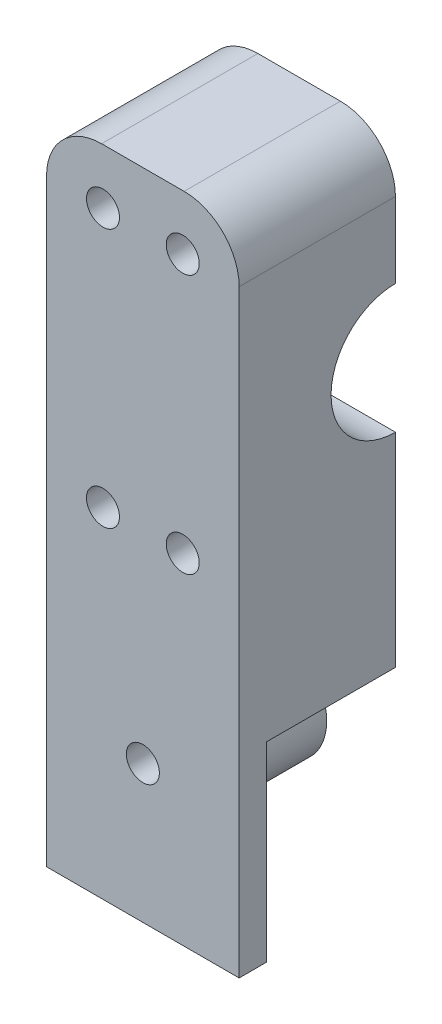
ISO-10303-21;
HEADER;
FILE_DESCRIPTION(('STEP AP214'),'2;1');
FILE_NAME('part.step','',(''),(''),'','','');
FILE_SCHEMA(('AUTOMOTIVE_DESIGN { 1 0 10303 214 1 1 1 1 }'));
ENDSEC;
DATA;
#1=APPLICATION_CONTEXT('core data for automotive mechanical design processes');
#2=APPLICATION_PROTOCOL_DEFINITION('international standard','automotive_design',2000,#1);
#3=PRODUCT_CONTEXT('',#1,'mechanical');
#4=PRODUCT('Part','Part','',(#3));
#5=PRODUCT_RELATED_PRODUCT_CATEGORY('part','',(#4));
#6=PRODUCT_DEFINITION_FORMATION('','',#4);
#7=PRODUCT_DEFINITION_CONTEXT('part definition',#1,'design');
#8=PRODUCT_DEFINITION('design','',#6,#7);
#9=PRODUCT_DEFINITION_SHAPE('','',#8);
#10=(LENGTH_UNIT() NAMED_UNIT(*) SI_UNIT(.MILLI.,.METRE.));
#11=(NAMED_UNIT(*) PLANE_ANGLE_UNIT() SI_UNIT($,.RADIAN.));
#12=(NAMED_UNIT(*) SI_UNIT($,.STERADIAN.) SOLID_ANGLE_UNIT());
#13=UNCERTAINTY_MEASURE_WITH_UNIT(LENGTH_MEASURE(1.E-05),#10,'distance_accuracy_value','');
#14=(GEOMETRIC_REPRESENTATION_CONTEXT(3) GLOBAL_UNCERTAINTY_ASSIGNED_CONTEXT((#13)) GLOBAL_UNIT_ASSIGNED_CONTEXT((#10,
#11,#12)) REPRESENTATION_CONTEXT('',''));
#15=CARTESIAN_POINT('',(0.,0.,0.));
#16=DIRECTION('',(0.,0.,1.));
#17=DIRECTION('',(1.,0.,0.));
#18=AXIS2_PLACEMENT_3D('',#15,#16,#17);
#19=CARTESIAN_POINT('',(10.25,49.4,-28.4));
#20=DIRECTION('',(0.,0.,1.));
#21=DIRECTION('',(1.,0.,0.));
#22=AXIS2_PLACEMENT_3D('',#19,#20,#21);
#23=CYLINDRICAL_SURFACE('',#22,3.);
#24=CARTESIAN_POINT('',(10.25,49.4,28.4));
#25=DIRECTION('',(0.,0.,-1.));
#26=DIRECTION('',(-1.,0.,0.));
#27=AXIS2_PLACEMENT_3D('',#24,#25,#26);
#28=CIRCLE('',#27,3.);
#29=CARTESIAN_POINT('',(7.25,49.4,28.4));
#30=VERTEX_POINT('',#29);
#31=EDGE_CURVE('E189',#30,#30,#28,.T.);
#32=ORIENTED_EDGE('',*,*,#31,.F.);
#33=EDGE_LOOP('',(#32));
#34=FACE_BOUND('',#33,.T.);
#35=CARTESIAN_POINT('',(10.25,49.4,5.));
#36=DIRECTION('',(0.,0.,-1.));
#37=DIRECTION('',(-1.,0.,0.));
#38=AXIS2_PLACEMENT_3D('',#35,#36,#37);
#39=CIRCLE('',#38,3.);
#40=CARTESIAN_POINT('',(7.25,49.4,5.));
#41=VERTEX_POINT('',#40);
#42=EDGE_CURVE('E297',#41,#41,#39,.T.);
#43=ORIENTED_EDGE('',*,*,#42,.T.);
#44=EDGE_LOOP('',(#43));
#45=FACE_BOUND('',#44,.T.);
#46=ADVANCED_FACE('F39',(#34,#45),#23,.F.);
#47=CARTESIAN_POINT('',(10.25,2.29999999999999,-28.4));
#48=DIRECTION('',(0.,0.,1.));
#49=DIRECTION('',(1.,0.,0.));
#50=AXIS2_PLACEMENT_3D('',#47,#48,#49);
#51=CYLINDRICAL_SURFACE('',#50,3.);
#52=CARTESIAN_POINT('',(10.25,2.29999999999999,28.4));
#53=DIRECTION('',(0.,0.,-1.));
#54=DIRECTION('',(-1.,0.,0.));
#55=AXIS2_PLACEMENT_3D('',#52,#53,#54);
#56=CIRCLE('',#55,3.);
#57=CARTESIAN_POINT('',(7.25,2.29999999999999,28.4));
#58=VERTEX_POINT('',#57);
#59=EDGE_CURVE('E197',#58,#58,#56,.T.);
#60=ORIENTED_EDGE('',*,*,#59,.F.);
#61=EDGE_LOOP('',(#60));
#62=FACE_BOUND('',#61,.T.);
#63=CARTESIAN_POINT('',(10.25,2.30000000000001,5.));
#64=DIRECTION('',(0.,0.,-1.));
#65=DIRECTION('',(-1.,0.,0.));
#66=AXIS2_PLACEMENT_3D('',#63,#64,#65);
#67=CIRCLE('',#66,3.);
#68=CARTESIAN_POINT('',(7.25,2.30000000000001,5.));
#69=VERTEX_POINT('',#68);
#70=EDGE_CURVE('E308',#69,#69,#67,.T.);
#71=ORIENTED_EDGE('',*,*,#70,.T.);
#72=EDGE_LOOP('',(#71));
#73=FACE_BOUND('',#72,.T.);
#74=ADVANCED_FACE('F352',(#62,#73),#51,.F.);
#75=CARTESIAN_POINT('',(24.75,2.29999999999999,-28.4));
#76=DIRECTION('',(0.,0.,1.));
#77=DIRECTION('',(1.,0.,0.));
#78=AXIS2_PLACEMENT_3D('',#75,#76,#77);
#79=CYLINDRICAL_SURFACE('',#78,3.);
#80=CARTESIAN_POINT('',(24.75,2.29999999999999,28.4));
#81=DIRECTION('',(0.,0.,-1.));
#82=DIRECTION('',(-1.,0.,0.));
#83=AXIS2_PLACEMENT_3D('',#80,#81,#82);
#84=CIRCLE('',#83,3.);
#85=CARTESIAN_POINT('',(21.75,2.29999999999999,28.4));
#86=VERTEX_POINT('',#85);
#87=EDGE_CURVE('E201',#86,#86,#84,.T.);
#88=ORIENTED_EDGE('',*,*,#87,.F.);
#89=EDGE_LOOP('',(#88));
#90=FACE_BOUND('',#89,.T.);
#91=CARTESIAN_POINT('',(24.75,2.30000000000001,5.));
#92=DIRECTION('',(0.,0.,-1.));
#93=DIRECTION('',(-1.,0.,0.));
#94=AXIS2_PLACEMENT_3D('',#91,#92,#93);
#95=CIRCLE('',#94,3.);
#96=CARTESIAN_POINT('',(21.75,2.30000000000001,5.));
#97=VERTEX_POINT('',#96);
#98=EDGE_CURVE('E298',#97,#97,#95,.T.);
#99=ORIENTED_EDGE('',*,*,#98,.T.);
#100=EDGE_LOOP('',(#99));
#101=FACE_BOUND('',#100,.T.);
#102=ADVANCED_FACE('F358',(#90,#101),#79,.F.);
#103=CARTESIAN_POINT('',(24.75,49.4,-28.4));
#104=DIRECTION('',(0.,0.,1.));
#105=DIRECTION('',(1.,0.,0.));
#106=AXIS2_PLACEMENT_3D('',#103,#104,#105);
#107=CYLINDRICAL_SURFACE('',#106,3.);
#108=CARTESIAN_POINT('',(24.75,49.4,28.4));
#109=DIRECTION('',(0.,0.,-1.));
#110=DIRECTION('',(-1.,0.,0.));
#111=AXIS2_PLACEMENT_3D('',#108,#109,#110);
#112=CIRCLE('',#111,3.);
#113=CARTESIAN_POINT('',(21.75,49.4,28.4));
#114=VERTEX_POINT('',#113);
#115=EDGE_CURVE('E205',#114,#114,#112,.T.);
#116=ORIENTED_EDGE('',*,*,#115,.F.);
#117=EDGE_LOOP('',(#116));
#118=FACE_BOUND('',#117,.T.);
#119=CARTESIAN_POINT('',(24.75,49.4,5.));
#120=DIRECTION('',(0.,0.,-1.));
#121=DIRECTION('',(-1.,0.,0.));
#122=AXIS2_PLACEMENT_3D('',#119,#120,#121);
#123=CIRCLE('',#122,3.);
#124=CARTESIAN_POINT('',(21.75,49.4,5.));
#125=VERTEX_POINT('',#124);
#126=EDGE_CURVE('E290',#125,#125,#123,.T.);
#127=ORIENTED_EDGE('',*,*,#126,.T.);
#128=EDGE_LOOP('',(#127));
#129=FACE_BOUND('',#128,.T.);
#130=ADVANCED_FACE('F365',(#118,#129),#107,.F.);
#131=CARTESIAN_POINT('',(17.5,-34.4,-60.1843274866922));
#132=DIRECTION('',(0.,0.,1.));
#133=DIRECTION('',(1.,0.,0.));
#134=AXIS2_PLACEMENT_3D('',#131,#132,#133);
#135=CYLINDRICAL_SURFACE('',#134,10.);
#136=CARTESIAN_POINT('',(17.5,-34.4,23.4));
#137=DIRECTION('',(0.,0.,1.));
#138=DIRECTION('',(0.,-1.,0.));
#139=AXIS2_PLACEMENT_3D('',#136,#137,#138);
#140=CIRCLE('',#139,10.);
#141=CARTESIAN_POINT('',(17.5,-44.4,23.4));
#142=VERTEX_POINT('',#141);
#143=EDGE_CURVE('E156',#142,#142,#140,.T.);
#144=ORIENTED_EDGE('',*,*,#143,.F.);
#145=EDGE_LOOP('',(#144));
#146=FACE_BOUND('',#145,.T.);
#147=CARTESIAN_POINT('',(17.5,-34.4,5.));
#148=DIRECTION('',(0.,0.,-1.));
#149=DIRECTION('',(0.,1.,0.));
#150=AXIS2_PLACEMENT_3D('',#147,#148,#149);
#151=CIRCLE('',#150,10.);
#152=CARTESIAN_POINT('',(17.5,-24.4,5.));
#153=VERTEX_POINT('',#152);
#154=EDGE_CURVE('E142',#153,#153,#151,.T.);
#155=ORIENTED_EDGE('',*,*,#154,.F.);
#156=EDGE_LOOP('',(#155));
#157=FACE_BOUND('',#156,.T.);
#158=ADVANCED_FACE('F369',(#146,#157),#135,.T.);
#159=CARTESIAN_POINT('',(17.5,-34.4,-28.4));
#160=DIRECTION('',(0.,0.,1.));
#161=DIRECTION('',(1.,0.,0.));
#162=AXIS2_PLACEMENT_3D('',#159,#160,#161);
#163=CYLINDRICAL_SURFACE('',#162,3.);
#164=CARTESIAN_POINT('',(17.5,-34.4,28.4));
#165=DIRECTION('',(0.,0.,-1.));
#166=DIRECTION('',(-1.,0.,0.));
#167=AXIS2_PLACEMENT_3D('',#164,#165,#166);
#168=CIRCLE('',#167,3.);
#169=CARTESIAN_POINT('',(14.5,-34.4,28.4));
#170=VERTEX_POINT('',#169);
#171=EDGE_CURVE('E193',#170,#170,#168,.T.);
#172=ORIENTED_EDGE('',*,*,#171,.F.);
#173=EDGE_LOOP('',(#172));
#174=FACE_BOUND('',#173,.T.);
#175=CARTESIAN_POINT('',(17.5,-34.4,5.));
#176=DIRECTION('',(0.,0.,-1.));
#177=DIRECTION('',(0.,1.,0.));
#178=AXIS2_PLACEMENT_3D('',#175,#176,#177);
#179=CIRCLE('',#178,3.);
#180=CARTESIAN_POINT('',(17.5,-31.4,5.));
#181=VERTEX_POINT('',#180);
#182=EDGE_CURVE('E281',#181,#181,#179,.T.);
#183=ORIENTED_EDGE('',*,*,#182,.T.);
#184=EDGE_LOOP('',(#183));
#185=FACE_BOUND('',#184,.T.);
#186=ADVANCED_FACE('F372',(#174,#185),#163,.F.);
#187=CARTESIAN_POINT('',(35.,0.,0.));
#188=DIRECTION('',(1.,0.,0.));
#189=DIRECTION('',(0.,0.,-1.));
#190=AXIS2_PLACEMENT_3D('',#187,#188,#189);
#191=PLANE('',#190);
#192=DIRECTION('',(0.,-1.,0.));
#193=VECTOR('',#192,1.);
#194=CARTESIAN_POINT('',(35.,59.4,0.));
#195=LINE('',#194,#193);
#196=CARTESIAN_POINT('',(35.,49.4,0.));
#197=VERTEX_POINT('',#196);
#198=CARTESIAN_POINT('',(35.,35.7,0.));
#199=VERTEX_POINT('',#198);
#200=EDGE_CURVE('E141',#197,#199,#195,.T.);
#201=ORIENTED_EDGE('',*,*,#200,.F.);
#202=DIRECTION('',(0.,0.,1.));
#203=VECTOR('',#202,1.);
#204=CARTESIAN_POINT('',(35.,49.4,28.4));
#205=LINE('',#204,#203);
#206=CARTESIAN_POINT('',(35.,49.4,28.4));
#207=VERTEX_POINT('',#206);
#208=EDGE_CURVE('E188',#197,#207,#205,.T.);
#209=ORIENTED_EDGE('',*,*,#208,.T.);
#210=DIRECTION('',(0.,-1.,0.));
#211=VECTOR('',#210,1.);
#212=CARTESIAN_POINT('',(35.,59.4,28.4));
#213=LINE('',#212,#211);
#214=CARTESIAN_POINT('',(35.,-59.4,28.4));
#215=VERTEX_POINT('',#214);
#216=EDGE_CURVE('E161',#207,#215,#213,.T.);
#217=ORIENTED_EDGE('',*,*,#216,.T.);
#218=DIRECTION('',(0.,0.,-1.));
#219=VECTOR('',#218,1.);
#220=CARTESIAN_POINT('',(35.,-59.4,28.4));
#221=LINE('',#220,#219);
#222=CARTESIAN_POINT('',(35.,-59.4,23.4));
#223=VERTEX_POINT('',#222);
#224=EDGE_CURVE('E164',#215,#223,#221,.T.);
#225=ORIENTED_EDGE('',*,*,#224,.T.);
#226=DIRECTION('',(0.,1.,0.));
#227=VECTOR('',#226,1.);
#228=CARTESIAN_POINT('',(35.,-14.4,23.4));
#229=LINE('',#228,#227);
#230=CARTESIAN_POINT('',(35.,-24.7175416344815,23.4));
#231=VERTEX_POINT('',#230);
#232=EDGE_CURVE('E168',#223,#231,#229,.T.);
#233=ORIENTED_EDGE('',*,*,#232,.T.);
#234=DIRECTION('',(0.,0.,1.));
#235=VECTOR('',#234,1.);
#236=CARTESIAN_POINT('',(35.,-24.7175416344815,-60.1843274866922));
#237=LINE('',#236,#235);
#238=CARTESIAN_POINT('',(35.,-24.7175416344815,0.));
#239=VERTEX_POINT('',#238);
#240=EDGE_CURVE('E139',#239,#231,#237,.T.);
#241=ORIENTED_EDGE('',*,*,#240,.F.);
#242=CARTESIAN_POINT('',(35.,12.3,0.));
#243=VERTEX_POINT('',#242);
#244=EDGE_CURVE('E120',#243,#239,#195,.T.);
#245=ORIENTED_EDGE('',*,*,#244,.F.);
#246=CARTESIAN_POINT('',(35.,24.,0.));
#247=DIRECTION('',(1.,0.,0.));
#248=DIRECTION('',(0.,0.,-1.));
#249=AXIS2_PLACEMENT_3D('',#246,#247,#248);
#250=CIRCLE('',#249,11.7);
#251=EDGE_CURVE('E137',#199,#243,#250,.T.);
#252=ORIENTED_EDGE('',*,*,#251,.F.);
#253=EDGE_LOOP('',(#201,#209,#217,#225,#233,#241,#245,#252));
#254=FACE_BOUND('',#253,.T.);
#255=ADVANCED_FACE('F136',(#254),#191,.T.);
#256=CARTESIAN_POINT('',(0.,0.,0.));
#257=DIRECTION('',(1.,0.,0.));
#258=DIRECTION('',(0.,0.,-1.));
#259=AXIS2_PLACEMENT_3D('',#256,#257,#258);
#260=PLANE('',#259);
#261=DIRECTION('',(0.,-1.,0.));
#262=VECTOR('',#261,1.);
#263=CARTESIAN_POINT('',(0.,59.4,28.4));
#264=LINE('',#263,#262);
#265=CARTESIAN_POINT('',(0.,49.4,28.4));
#266=VERTEX_POINT('',#265);
#267=CARTESIAN_POINT('',(0.,-59.4,28.4));
#268=VERTEX_POINT('',#267);
#269=EDGE_CURVE('E148',#266,#268,#264,.T.);
#270=ORIENTED_EDGE('',*,*,#269,.F.);
#271=DIRECTION('',(0.,0.,1.));
#272=VECTOR('',#271,1.);
#273=CARTESIAN_POINT('',(0.,49.4,0.));
#274=LINE('',#273,#272);
#275=CARTESIAN_POINT('',(0.,49.4,0.));
#276=VERTEX_POINT('',#275);
#277=EDGE_CURVE('E11',#266,#276,#274,.F.);
#278=ORIENTED_EDGE('',*,*,#277,.T.);
#279=DIRECTION('',(0.,-1.,0.));
#280=VECTOR('',#279,1.);
#281=CARTESIAN_POINT('',(0.,59.4,0.));
#282=LINE('',#281,#280);
#283=CARTESIAN_POINT('',(0.,35.7,0.));
#284=VERTEX_POINT('',#283);
#285=EDGE_CURVE('E274',#276,#284,#282,.T.);
#286=ORIENTED_EDGE('',*,*,#285,.T.);
#287=CARTESIAN_POINT('',(0.,24.,0.));
#288=DIRECTION('',(1.,0.,0.));
#289=DIRECTION('',(0.,0.,-1.));
#290=AXIS2_PLACEMENT_3D('',#287,#288,#289);
#291=CIRCLE('',#290,11.7);
#292=CARTESIAN_POINT('',(0.,12.3,0.));
#293=VERTEX_POINT('',#292);
#294=EDGE_CURVE('E149',#284,#293,#291,.T.);
#295=ORIENTED_EDGE('',*,*,#294,.T.);
#296=CARTESIAN_POINT('',(0.,-24.7175416344815,0.));
#297=VERTEX_POINT('',#296);
#298=EDGE_CURVE('E123',#293,#297,#282,.T.);
#299=ORIENTED_EDGE('',*,*,#298,.T.);
#300=DIRECTION('',(0.,0.,1.));
#301=VECTOR('',#300,1.);
#302=CARTESIAN_POINT('',(0.,-24.7175416344815,-60.1843274866922));
#303=LINE('',#302,#301);
#304=CARTESIAN_POINT('',(0.,-24.7175416344815,23.4));
#305=VERTEX_POINT('',#304);
#306=EDGE_CURVE('E260',#297,#305,#303,.T.);
#307=ORIENTED_EDGE('',*,*,#306,.T.);
#308=DIRECTION('',(0.,1.,0.));
#309=VECTOR('',#308,1.);
#310=CARTESIAN_POINT('',(0.,-14.4,23.4));
#311=LINE('',#310,#309);
#312=CARTESIAN_POINT('',(0.,-59.4,23.4));
#313=VERTEX_POINT('',#312);
#314=EDGE_CURVE('E165',#313,#305,#311,.T.);
#315=ORIENTED_EDGE('',*,*,#314,.F.);
#316=DIRECTION('',(0.,0.,-1.));
#317=VECTOR('',#316,1.);
#318=CARTESIAN_POINT('',(0.,-59.4,28.4));
#319=LINE('',#318,#317);
#320=EDGE_CURVE('E154',#268,#313,#319,.T.);
#321=ORIENTED_EDGE('',*,*,#320,.F.);
#322=EDGE_LOOP('',(#270,#278,#286,#295,#299,#307,#315,#321));
#323=FACE_BOUND('',#322,.T.);
#324=ADVANCED_FACE('F245',(#323),#260,.F.);
#325=CARTESIAN_POINT('',(35.,59.4,28.4));
#326=DIRECTION('',(0.,-1.,0.));
#327=DIRECTION('',(0.,0.,-1.));
#328=AXIS2_PLACEMENT_3D('',#325,#326,#327);
#329=PLANE('',#328);
#330=DIRECTION('',(-1.,0.,0.));
#331=VECTOR('',#330,1.);
#332=CARTESIAN_POINT('',(35.,59.4,28.4));
#333=LINE('',#332,#331);
#334=CARTESIAN_POINT('',(25.,59.4,28.4));
#335=VERTEX_POINT('',#334);
#336=CARTESIAN_POINT('',(10.,59.4,28.4));
#337=VERTEX_POINT('',#336);
#338=EDGE_CURVE('E184',#335,#337,#333,.T.);
#339=ORIENTED_EDGE('',*,*,#338,.F.);
#340=DIRECTION('',(0.,0.,1.));
#341=VECTOR('',#340,1.);
#342=CARTESIAN_POINT('',(25.,59.4,0.));
#343=LINE('',#342,#341);
#344=CARTESIAN_POINT('',(25.,59.4,0.));
#345=VERTEX_POINT('',#344);
#346=EDGE_CURVE('E61',#335,#345,#343,.F.);
#347=ORIENTED_EDGE('',*,*,#346,.T.);
#348=DIRECTION('',(1.,0.,0.));
#349=VECTOR('',#348,1.);
#350=CARTESIAN_POINT('',(0.,59.4,0.));
#351=LINE('',#350,#349);
#352=CARTESIAN_POINT('',(10.,59.4,0.));
#353=VERTEX_POINT('',#352);
#354=EDGE_CURVE('E231',#353,#345,#351,.T.);
#355=ORIENTED_EDGE('',*,*,#354,.F.);
#356=DIRECTION('',(0.,0.,1.));
#357=VECTOR('',#356,1.);
#358=CARTESIAN_POINT('',(10.,59.4,28.4));
#359=LINE('',#358,#357);
#360=EDGE_CURVE('E218',#353,#337,#359,.T.);
#361=ORIENTED_EDGE('',*,*,#360,.T.);
#362=EDGE_LOOP('',(#339,#347,#355,#361));
#363=FACE_BOUND('',#362,.T.);
#364=ADVANCED_FACE('F240',(#363),#329,.F.);
#365=CARTESIAN_POINT('',(35.,59.4,28.4));
#366=DIRECTION('',(0.,0.,-1.));
#367=DIRECTION('',(-1.,0.,0.));
#368=AXIS2_PLACEMENT_3D('',#365,#366,#367);
#369=PLANE('',#368);
#370=ORIENTED_EDGE('',*,*,#115,.T.);
#371=EDGE_LOOP('',(#370));
#372=FACE_BOUND('',#371,.T.);
#373=ORIENTED_EDGE('',*,*,#87,.T.);
#374=EDGE_LOOP('',(#373));
#375=FACE_BOUND('',#374,.T.);
#376=ORIENTED_EDGE('',*,*,#59,.T.);
#377=EDGE_LOOP('',(#376));
#378=FACE_BOUND('',#377,.T.);
#379=ORIENTED_EDGE('',*,*,#171,.T.);
#380=EDGE_LOOP('',(#379));
#381=FACE_BOUND('',#380,.T.);
#382=ORIENTED_EDGE('',*,*,#31,.T.);
#383=EDGE_LOOP('',(#382));
#384=FACE_BOUND('',#383,.T.);
#385=ORIENTED_EDGE('',*,*,#216,.F.);
#386=CARTESIAN_POINT('',(25.,49.4,28.4));
#387=DIRECTION('',(0.,0.,-1.));
#388=DIRECTION('',(-1.,0.,0.));
#389=AXIS2_PLACEMENT_3D('',#386,#387,#388);
#390=CIRCLE('',#389,10.);
#391=EDGE_CURVE('E215',#207,#335,#390,.F.);
#392=ORIENTED_EDGE('',*,*,#391,.T.);
#393=ORIENTED_EDGE('',*,*,#338,.T.);
#394=CARTESIAN_POINT('',(10.,49.4,28.4));
#395=DIRECTION('',(0.,0.,-1.));
#396=DIRECTION('',(-1.,0.,0.));
#397=AXIS2_PLACEMENT_3D('',#394,#395,#396);
#398=CIRCLE('',#397,10.);
#399=EDGE_CURVE('E212',#337,#266,#398,.F.);
#400=ORIENTED_EDGE('',*,*,#399,.T.);
#401=ORIENTED_EDGE('',*,*,#269,.T.);
#402=DIRECTION('',(-1.,0.,0.));
#403=VECTOR('',#402,1.);
#404=CARTESIAN_POINT('',(35.,-59.4,28.4));
#405=LINE('',#404,#403);
#406=EDGE_CURVE('E180',#215,#268,#405,.T.);
#407=ORIENTED_EDGE('',*,*,#406,.F.);
#408=EDGE_LOOP('',(#385,#392,#393,#400,#401,#407));
#409=FACE_BOUND('',#408,.T.);
#410=ADVANCED_FACE('F238',(#372,#375,#378,#381,#384,#409),#369,.F.);
#411=CARTESIAN_POINT('',(35.,-59.4,28.4));
#412=DIRECTION('',(0.,1.,0.));
#413=DIRECTION('',(0.,0.,1.));
#414=AXIS2_PLACEMENT_3D('',#411,#412,#413);
#415=PLANE('',#414);
#416=ORIENTED_EDGE('',*,*,#320,.T.);
#417=DIRECTION('',(-1.,0.,0.));
#418=VECTOR('',#417,1.);
#419=CARTESIAN_POINT('',(35.,-59.4,23.4));
#420=LINE('',#419,#418);
#421=EDGE_CURVE('E170',#223,#313,#420,.T.);
#422=ORIENTED_EDGE('',*,*,#421,.F.);
#423=ORIENTED_EDGE('',*,*,#224,.F.);
#424=ORIENTED_EDGE('',*,*,#406,.T.);
#425=EDGE_LOOP('',(#416,#422,#423,#424));
#426=FACE_BOUND('',#425,.T.);
#427=ADVANCED_FACE('F249',(#426),#415,.F.);
#428=CARTESIAN_POINT('',(35.,-14.4,23.4));
#429=DIRECTION('',(0.,0.,1.));
#430=DIRECTION('',(0.,-1.,0.));
#431=AXIS2_PLACEMENT_3D('',#428,#429,#430);
#432=PLANE('',#431);
#433=ORIENTED_EDGE('',*,*,#143,.T.);
#434=EDGE_LOOP('',(#433));
#435=FACE_BOUND('',#434,.T.);
#436=ORIENTED_EDGE('',*,*,#314,.T.);
#437=CARTESIAN_POINT('',(17.5,-34.4,23.4));
#438=DIRECTION('',(0.,0.,1.));
#439=DIRECTION('',(0.,-1.,0.));
#440=AXIS2_PLACEMENT_3D('',#437,#438,#439);
#441=CIRCLE('',#440,20.);
#442=EDGE_CURVE('E256',#305,#231,#441,.F.);
#443=ORIENTED_EDGE('',*,*,#442,.T.);
#444=ORIENTED_EDGE('',*,*,#232,.F.);
#445=ORIENTED_EDGE('',*,*,#421,.T.);
#446=EDGE_LOOP('',(#436,#443,#444,#445));
#447=FACE_BOUND('',#446,.T.);
#448=ADVANCED_FACE('F253',(#435,#447),#432,.F.);
#449=CARTESIAN_POINT('',(35.,24.,0.));
#450=DIRECTION('',(-1.,0.,0.));
#451=DIRECTION('',(0.,0.,1.));
#452=AXIS2_PLACEMENT_3D('',#449,#450,#451);
#453=CYLINDRICAL_SURFACE('',#452,11.7);
#454=DIRECTION('',(-1.,0.,0.));
#455=VECTOR('',#454,1.);
#456=CARTESIAN_POINT('',(35.,35.7,0.));
#457=LINE('',#456,#455);
#458=EDGE_CURVE('E129',#199,#284,#457,.T.);
#459=ORIENTED_EDGE('',*,*,#458,.F.);
#460=ORIENTED_EDGE('',*,*,#251,.T.);
#461=DIRECTION('',(-1.,0.,0.));
#462=VECTOR('',#461,1.);
#463=CARTESIAN_POINT('',(35.,12.3,0.));
#464=LINE('',#463,#462);
#465=EDGE_CURVE('E117',#293,#243,#464,.F.);
#466=ORIENTED_EDGE('',*,*,#465,.F.);
#467=ORIENTED_EDGE('',*,*,#294,.F.);
#468=EDGE_LOOP('',(#459,#460,#466,#467));
#469=FACE_BOUND('',#468,.T.);
#470=ADVANCED_FACE('F145',(#469),#453,.F.);
#471=CARTESIAN_POINT('',(17.5,-34.4,-60.1843274866922));
#472=DIRECTION('',(0.,0.,1.));
#473=DIRECTION('',(1.,0.,0.));
#474=AXIS2_PLACEMENT_3D('',#471,#472,#473);
#475=CYLINDRICAL_SURFACE('',#474,20.);
#476=CARTESIAN_POINT('',(17.5,-34.4,0.));
#477=DIRECTION('',(0.,0.,1.));
#478=DIRECTION('',(0.,-1.,0.));
#479=AXIS2_PLACEMENT_3D('',#476,#477,#478);
#480=CIRCLE('',#479,20.);
#481=EDGE_CURVE('E130',#239,#297,#480,.T.);
#482=ORIENTED_EDGE('',*,*,#481,.F.);
#483=ORIENTED_EDGE('',*,*,#240,.T.);
#484=ORIENTED_EDGE('',*,*,#442,.F.);
#485=ORIENTED_EDGE('',*,*,#306,.F.);
#486=EDGE_LOOP('',(#482,#483,#484,#485));
#487=FACE_BOUND('',#486,.T.);
#488=ADVANCED_FACE('F347',(#487),#475,.F.);
#489=CARTESIAN_POINT('',(0.,59.4,0.));
#490=DIRECTION('',(0.,0.,1.));
#491=DIRECTION('',(0.,-1.,0.));
#492=AXIS2_PLACEMENT_3D('',#489,#490,#491);
#493=PLANE('',#492);
#494=CARTESIAN_POINT('',(10.25,49.4,0.));
#495=DIRECTION('',(0.,0.,-1.));
#496=DIRECTION('',(-1.,0.,0.));
#497=AXIS2_PLACEMENT_3D('',#494,#495,#496);
#498=CIRCLE('',#497,4.);
#499=CARTESIAN_POINT('',(6.25,49.4,0.));
#500=VERTEX_POINT('',#499);
#501=EDGE_CURVE('E315',#500,#500,#498,.T.);
#502=ORIENTED_EDGE('',*,*,#501,.F.);
#503=EDGE_LOOP('',(#502));
#504=FACE_BOUND('',#503,.T.);
#505=CARTESIAN_POINT('',(24.75,49.4,0.));
#506=DIRECTION('',(0.,0.,-1.));
#507=DIRECTION('',(-1.,0.,0.));
#508=AXIS2_PLACEMENT_3D('',#505,#506,#507);
#509=CIRCLE('',#508,3.99999999999999);
#510=CARTESIAN_POINT('',(20.75,49.4,0.));
#511=VERTEX_POINT('',#510);
#512=EDGE_CURVE('E286',#511,#511,#509,.T.);
#513=ORIENTED_EDGE('',*,*,#512,.F.);
#514=EDGE_LOOP('',(#513));
#515=FACE_BOUND('',#514,.T.);
#516=ORIENTED_EDGE('',*,*,#354,.T.);
#517=CARTESIAN_POINT('',(25.,49.4,0.));
#518=DIRECTION('',(0.,0.,1.));
#519=DIRECTION('',(0.,-1.,0.));
#520=AXIS2_PLACEMENT_3D('',#517,#518,#519);
#521=CIRCLE('',#520,10.);
#522=EDGE_CURVE('E48',#345,#197,#521,.F.);
#523=ORIENTED_EDGE('',*,*,#522,.T.);
#524=ORIENTED_EDGE('',*,*,#200,.T.);
#525=ORIENTED_EDGE('',*,*,#458,.T.);
#526=ORIENTED_EDGE('',*,*,#285,.F.);
#527=CARTESIAN_POINT('',(10.,49.4,0.));
#528=DIRECTION('',(0.,0.,1.));
#529=DIRECTION('',(0.,-1.,0.));
#530=AXIS2_PLACEMENT_3D('',#527,#528,#529);
#531=CIRCLE('',#530,10.);
#532=EDGE_CURVE('E224',#276,#353,#531,.F.);
#533=ORIENTED_EDGE('',*,*,#532,.T.);
#534=EDGE_LOOP('',(#516,#523,#524,#525,#526,#533));
#535=FACE_BOUND('',#534,.T.);
#536=ADVANCED_FACE('F230',(#504,#515,#535),#493,.F.);
#537=CARTESIAN_POINT('',(24.75,2.30000000000001,0.));
#538=DIRECTION('',(0.,0.,-1.));
#539=DIRECTION('',(-1.,0.,0.));
#540=AXIS2_PLACEMENT_3D('',#537,#538,#539);
#541=CIRCLE('',#540,4.);
#542=CARTESIAN_POINT('',(20.75,2.30000000000001,0.));
#543=VERTEX_POINT('',#542);
#544=EDGE_CURVE('E303',#543,#543,#541,.T.);
#545=ORIENTED_EDGE('',*,*,#544,.F.);
#546=EDGE_LOOP('',(#545));
#547=FACE_BOUND('',#546,.T.);
#548=CARTESIAN_POINT('',(10.25,2.30000000000001,0.));
#549=DIRECTION('',(0.,0.,-1.));
#550=DIRECTION('',(-1.,0.,0.));
#551=AXIS2_PLACEMENT_3D('',#548,#549,#550);
#552=CIRCLE('',#551,4.);
#553=CARTESIAN_POINT('',(6.25,2.30000000000001,0.));
#554=VERTEX_POINT('',#553);
#555=EDGE_CURVE('E325',#554,#554,#552,.T.);
#556=ORIENTED_EDGE('',*,*,#555,.F.);
#557=EDGE_LOOP('',(#556));
#558=FACE_BOUND('',#557,.T.);
#559=ORIENTED_EDGE('',*,*,#465,.T.);
#560=ORIENTED_EDGE('',*,*,#244,.T.);
#561=ORIENTED_EDGE('',*,*,#481,.T.);
#562=ORIENTED_EDGE('',*,*,#298,.F.);
#563=EDGE_LOOP('',(#559,#560,#561,#562));
#564=FACE_BOUND('',#563,.T.);
#565=ADVANCED_FACE('F119',(#547,#558,#564),#493,.F.);
#566=CARTESIAN_POINT('',(17.5,-34.4,5.));
#567=DIRECTION('',(0.,0.,-1.));
#568=DIRECTION('',(0.,1.,0.));
#569=AXIS2_PLACEMENT_3D('',#566,#567,#568);
#570=PLANE('',#569);
#571=ORIENTED_EDGE('',*,*,#182,.F.);
#572=EDGE_LOOP('',(#571));
#573=FACE_BOUND('',#572,.T.);
#574=ORIENTED_EDGE('',*,*,#154,.T.);
#575=EDGE_LOOP('',(#574));
#576=FACE_BOUND('',#575,.T.);
#577=ADVANCED_FACE('F338',(#573,#576),#570,.T.);
#578=CARTESIAN_POINT('',(10.25,2.30000000000001,5.));
#579=DIRECTION('',(0.,0.,-1.));
#580=DIRECTION('',(-1.,0.,0.));
#581=AXIS2_PLACEMENT_3D('',#578,#579,#580);
#582=CYLINDRICAL_SURFACE('',#581,4.);
#583=CARTESIAN_POINT('',(10.25,2.30000000000001,5.));
#584=DIRECTION('',(0.,0.,-1.));
#585=DIRECTION('',(-1.,0.,0.));
#586=AXIS2_PLACEMENT_3D('',#583,#584,#585);
#587=CIRCLE('',#586,4.);
#588=CARTESIAN_POINT('',(6.25,2.30000000000001,5.));
#589=VERTEX_POINT('',#588);
#590=EDGE_CURVE('E326',#589,#589,#587,.T.);
#591=ORIENTED_EDGE('',*,*,#590,.F.);
#592=EDGE_LOOP('',(#591));
#593=FACE_BOUND('',#592,.T.);
#594=ORIENTED_EDGE('',*,*,#555,.T.);
#595=EDGE_LOOP('',(#594));
#596=FACE_BOUND('',#595,.T.);
#597=ADVANCED_FACE('F335',(#593,#596),#582,.F.);
#598=CARTESIAN_POINT('',(10.25,2.30000000000001,5.));
#599=DIRECTION('',(0.,0.,-1.));
#600=DIRECTION('',(-1.,0.,0.));
#601=AXIS2_PLACEMENT_3D('',#598,#599,#600);
#602=PLANE('',#601);
#603=ORIENTED_EDGE('',*,*,#70,.F.);
#604=EDGE_LOOP('',(#603));
#605=FACE_BOUND('',#604,.T.);
#606=ORIENTED_EDGE('',*,*,#590,.T.);
#607=EDGE_LOOP('',(#606));
#608=FACE_BOUND('',#607,.T.);
#609=ADVANCED_FACE('F412',(#605,#608),#602,.T.);
#610=CARTESIAN_POINT('',(24.75,2.30000000000001,5.));
#611=DIRECTION('',(0.,0.,-1.));
#612=DIRECTION('',(-1.,0.,0.));
#613=AXIS2_PLACEMENT_3D('',#610,#611,#612);
#614=CYLINDRICAL_SURFACE('',#613,4.);
#615=CARTESIAN_POINT('',(24.75,2.30000000000001,5.));
#616=DIRECTION('',(0.,0.,-1.));
#617=DIRECTION('',(-1.,0.,0.));
#618=AXIS2_PLACEMENT_3D('',#615,#616,#617);
#619=CIRCLE('',#618,4.);
#620=CARTESIAN_POINT('',(20.75,2.30000000000001,5.));
#621=VERTEX_POINT('',#620);
#622=EDGE_CURVE('E304',#621,#621,#619,.T.);
#623=ORIENTED_EDGE('',*,*,#622,.F.);
#624=EDGE_LOOP('',(#623));
#625=FACE_BOUND('',#624,.T.);
#626=ORIENTED_EDGE('',*,*,#544,.T.);
#627=EDGE_LOOP('',(#626));
#628=FACE_BOUND('',#627,.T.);
#629=ADVANCED_FACE('F408',(#625,#628),#614,.F.);
#630=CARTESIAN_POINT('',(24.75,2.30000000000001,5.));
#631=DIRECTION('',(0.,0.,-1.));
#632=DIRECTION('',(-1.,0.,0.));
#633=AXIS2_PLACEMENT_3D('',#630,#631,#632);
#634=PLANE('',#633);
#635=ORIENTED_EDGE('',*,*,#98,.F.);
#636=EDGE_LOOP('',(#635));
#637=FACE_BOUND('',#636,.T.);
#638=ORIENTED_EDGE('',*,*,#622,.T.);
#639=EDGE_LOOP('',(#638));
#640=FACE_BOUND('',#639,.T.);
#641=ADVANCED_FACE('F411',(#637,#640),#634,.T.);
#642=CARTESIAN_POINT('',(24.75,49.4,5.));
#643=DIRECTION('',(0.,0.,-1.));
#644=DIRECTION('',(-1.,0.,0.));
#645=AXIS2_PLACEMENT_3D('',#642,#643,#644);
#646=CYLINDRICAL_SURFACE('',#645,3.99999999999999);
#647=CARTESIAN_POINT('',(24.75,49.4,5.));
#648=DIRECTION('',(0.,0.,-1.));
#649=DIRECTION('',(-1.,0.,0.));
#650=AXIS2_PLACEMENT_3D('',#647,#648,#649);
#651=CIRCLE('',#650,3.99999999999999);
#652=CARTESIAN_POINT('',(20.75,49.4,5.));
#653=VERTEX_POINT('',#652);
#654=EDGE_CURVE('E285',#653,#653,#651,.T.);
#655=ORIENTED_EDGE('',*,*,#654,.F.);
#656=EDGE_LOOP('',(#655));
#657=FACE_BOUND('',#656,.T.);
#658=ORIENTED_EDGE('',*,*,#512,.T.);
#659=EDGE_LOOP('',(#658));
#660=FACE_BOUND('',#659,.T.);
#661=ADVANCED_FACE('F416',(#657,#660),#646,.F.);
#662=CARTESIAN_POINT('',(24.75,49.4,5.));
#663=DIRECTION('',(0.,0.,-1.));
#664=DIRECTION('',(-1.,0.,0.));
#665=AXIS2_PLACEMENT_3D('',#662,#663,#664);
#666=PLANE('',#665);
#667=ORIENTED_EDGE('',*,*,#126,.F.);
#668=EDGE_LOOP('',(#667));
#669=FACE_BOUND('',#668,.T.);
#670=ORIENTED_EDGE('',*,*,#654,.T.);
#671=EDGE_LOOP('',(#670));
#672=FACE_BOUND('',#671,.T.);
#673=ADVANCED_FACE('F401',(#669,#672),#666,.T.);
#674=CARTESIAN_POINT('',(10.25,49.4,5.));
#675=DIRECTION('',(0.,0.,-1.));
#676=DIRECTION('',(-1.,0.,0.));
#677=AXIS2_PLACEMENT_3D('',#674,#675,#676);
#678=CYLINDRICAL_SURFACE('',#677,4.);
#679=CARTESIAN_POINT('',(10.25,49.4,5.));
#680=DIRECTION('',(0.,0.,-1.));
#681=DIRECTION('',(-1.,0.,0.));
#682=AXIS2_PLACEMENT_3D('',#679,#680,#681);
#683=CIRCLE('',#682,4.);
#684=CARTESIAN_POINT('',(6.25,49.4,5.));
#685=VERTEX_POINT('',#684);
#686=EDGE_CURVE('E302',#685,#685,#683,.T.);
#687=ORIENTED_EDGE('',*,*,#686,.F.);
#688=EDGE_LOOP('',(#687));
#689=FACE_BOUND('',#688,.T.);
#690=ORIENTED_EDGE('',*,*,#501,.T.);
#691=EDGE_LOOP('',(#690));
#692=FACE_BOUND('',#691,.T.);
#693=ADVANCED_FACE('F395',(#689,#692),#678,.F.);
#694=CARTESIAN_POINT('',(10.25,49.4,5.));
#695=DIRECTION('',(0.,0.,-1.));
#696=DIRECTION('',(-1.,0.,0.));
#697=AXIS2_PLACEMENT_3D('',#694,#695,#696);
#698=PLANE('',#697);
#699=ORIENTED_EDGE('',*,*,#42,.F.);
#700=EDGE_LOOP('',(#699));
#701=FACE_BOUND('',#700,.T.);
#702=ORIENTED_EDGE('',*,*,#686,.T.);
#703=EDGE_LOOP('',(#702));
#704=FACE_BOUND('',#703,.T.);
#705=ADVANCED_FACE('F390',(#701,#704),#698,.T.);
#706=CARTESIAN_POINT('',(25.,49.4,0.));
#707=DIRECTION('',(0.,0.,-1.));
#708=DIRECTION('',(0.,1.,0.));
#709=AXIS2_PLACEMENT_3D('',#706,#707,#708);
#710=CYLINDRICAL_SURFACE('',#709,10.);
#711=ORIENTED_EDGE('',*,*,#522,.F.);
#712=ORIENTED_EDGE('',*,*,#346,.F.);
#713=ORIENTED_EDGE('',*,*,#391,.F.);
#714=ORIENTED_EDGE('',*,*,#208,.F.);
#715=EDGE_LOOP('',(#711,#712,#713,#714));
#716=FACE_BOUND('',#715,.T.);
#717=ADVANCED_FACE('F236',(#716),#710,.T.);
#718=CARTESIAN_POINT('',(10.,49.4,28.4));
#719=DIRECTION('',(0.,0.,1.));
#720=DIRECTION('',(0.,-1.,0.));
#721=AXIS2_PLACEMENT_3D('',#718,#719,#720);
#722=CYLINDRICAL_SURFACE('',#721,10.);
#723=ORIENTED_EDGE('',*,*,#532,.F.);
#724=ORIENTED_EDGE('',*,*,#277,.F.);
#725=ORIENTED_EDGE('',*,*,#399,.F.);
#726=ORIENTED_EDGE('',*,*,#360,.F.);
#727=EDGE_LOOP('',(#723,#724,#725,#726));
#728=FACE_BOUND('',#727,.T.);
#729=ADVANCED_FACE('F41',(#728),#722,.T.);
#730=CLOSED_SHELL('',(#46,#74,#102,#130,#158,#186,#255,#324,#364,#410,#427,#448,#470,#488,#536,
#565,#577,#597,#609,#629,#641,#661,#673,#693,#705,#717,#729));
#731=MANIFOLD_SOLID_BREP('B2',#730);
#732=ADVANCED_BREP_SHAPE_REPRESENTATION('',(#18,#731),#14);
#733=SHAPE_DEFINITION_REPRESENTATION(#9,#732);
ENDSEC;
END-ISO-10303-21;
